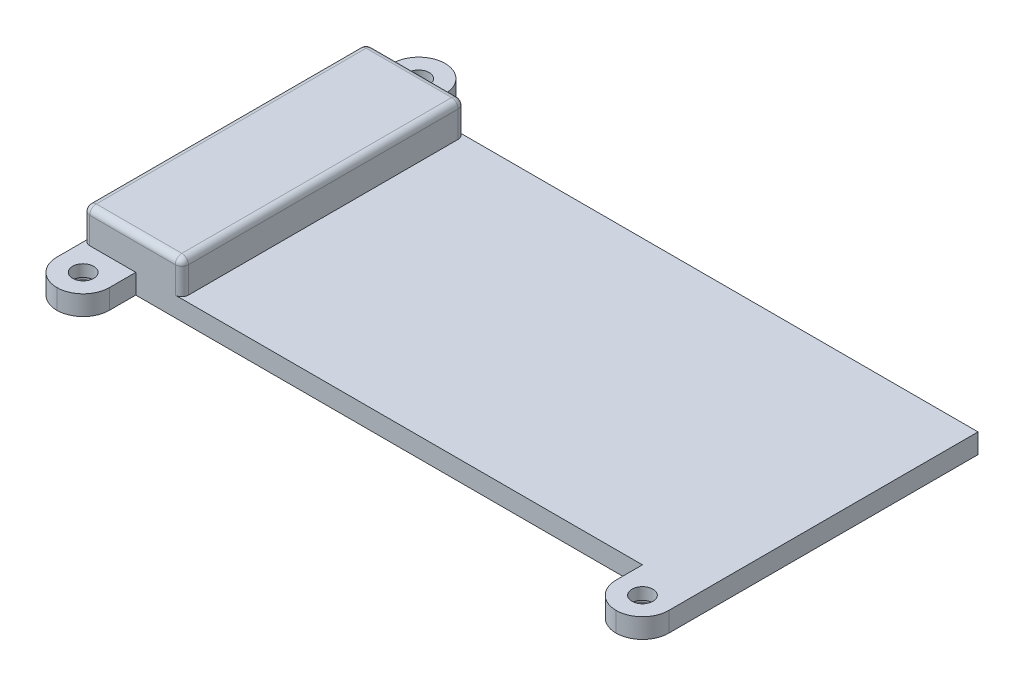
ISO-10303-21;
HEADER;
FILE_DESCRIPTION(('STEP AP214'),'2;1');
FILE_NAME('part.step','',(''),(''),'','','');
FILE_SCHEMA(('AUTOMOTIVE_DESIGN { 1 0 10303 214 1 1 1 1 }'));
ENDSEC;
DATA;
#1=APPLICATION_CONTEXT('core data for automotive mechanical design processes');
#2=APPLICATION_PROTOCOL_DEFINITION('international standard','automotive_design',2000,#1);
#3=PRODUCT_CONTEXT('',#1,'mechanical');
#4=PRODUCT('Part','Part','',(#3));
#5=PRODUCT_RELATED_PRODUCT_CATEGORY('part','',(#4));
#6=PRODUCT_DEFINITION_FORMATION('','',#4);
#7=PRODUCT_DEFINITION_CONTEXT('part definition',#1,'design');
#8=PRODUCT_DEFINITION('design','',#6,#7);
#9=PRODUCT_DEFINITION_SHAPE('','',#8);
#10=(LENGTH_UNIT() NAMED_UNIT(*) SI_UNIT(.MILLI.,.METRE.));
#11=(NAMED_UNIT(*) PLANE_ANGLE_UNIT() SI_UNIT($,.RADIAN.));
#12=(NAMED_UNIT(*) SI_UNIT($,.STERADIAN.) SOLID_ANGLE_UNIT());
#13=UNCERTAINTY_MEASURE_WITH_UNIT(LENGTH_MEASURE(1.E-05),#10,'distance_accuracy_value','');
#14=(GEOMETRIC_REPRESENTATION_CONTEXT(3) GLOBAL_UNCERTAINTY_ASSIGNED_CONTEXT((#13)) GLOBAL_UNIT_ASSIGNED_CONTEXT((#10,
#11,#12)) REPRESENTATION_CONTEXT('',''));
#15=CARTESIAN_POINT('',(0.,0.,0.));
#16=DIRECTION('',(0.,0.,1.));
#17=DIRECTION('',(1.,0.,0.));
#18=AXIS2_PLACEMENT_3D('',#15,#16,#17);
#19=CARTESIAN_POINT('',(0.,3.,0.));
#20=DIRECTION('',(0.,1.,0.));
#21=DIRECTION('',(0.,0.,1.));
#22=AXIS2_PLACEMENT_3D('',#19,#20,#21);
#23=PLANE('',#22);
#24=DIRECTION('',(0.,0.,-1.));
#25=VECTOR('',#24,1.);
#26=CARTESIAN_POINT('',(46.5,3.,-21.5));
#27=LINE('',#26,#25);
#28=CARTESIAN_POINT('',(46.4999999999999,3.,25.5));
#29=VERTEX_POINT('',#28);
#30=CARTESIAN_POINT('',(46.5,3.,-21.5));
#31=VERTEX_POINT('',#30);
#32=EDGE_CURVE('E214',#29,#31,#27,.T.);
#33=ORIENTED_EDGE('',*,*,#32,.T.);
#34=DIRECTION('',(-1.,0.,0.));
#35=VECTOR('',#34,1.);
#36=CARTESIAN_POINT('',(-38.5000000000001,3.,-21.4999999999999));
#37=LINE('',#36,#35);
#38=CARTESIAN_POINT('',(-32.5,3.,-21.4999999999999));
#39=VERTEX_POINT('',#38);
#40=EDGE_CURVE('E202',#31,#39,#37,.T.);
#41=ORIENTED_EDGE('',*,*,#40,.T.);
#42=CARTESIAN_POINT('',(-32.5,3.,-20.4999999999999));
#43=DIRECTION('',(0.,1.,0.));
#44=DIRECTION('',(0.,0.,1.));
#45=AXIS2_PLACEMENT_3D('',#42,#43,#44);
#46=CIRCLE('',#45,1.);
#47=CARTESIAN_POINT('',(-31.5,3.,-20.4999999999999));
#48=VERTEX_POINT('',#47);
#49=EDGE_CURVE('E55',#39,#48,#46,.F.);
#50=ORIENTED_EDGE('',*,*,#49,.T.);
#51=DIRECTION('',(0.,0.,-1.));
#52=VECTOR('',#51,1.);
#53=CARTESIAN_POINT('',(-31.5,3.,-21.5));
#54=LINE('',#53,#52);
#55=CARTESIAN_POINT('',(-31.5,3.,20.5000000000001));
#56=VERTEX_POINT('',#55);
#57=EDGE_CURVE('E471',#56,#48,#54,.T.);
#58=ORIENTED_EDGE('',*,*,#57,.F.);
#59=CARTESIAN_POINT('',(-32.5,3.,20.5000000000001));
#60=DIRECTION('',(0.,1.,0.));
#61=DIRECTION('',(0.,0.,1.));
#62=AXIS2_PLACEMENT_3D('',#59,#60,#61);
#63=CIRCLE('',#62,1.);
#64=CARTESIAN_POINT('',(-32.5,3.,21.5000000000001));
#65=VERTEX_POINT('',#64);
#66=EDGE_CURVE('E417',#56,#65,#63,.F.);
#67=ORIENTED_EDGE('',*,*,#66,.T.);
#68=DIRECTION('',(1.,0.,0.));
#69=VECTOR('',#68,1.);
#70=CARTESIAN_POINT('',(-38.5,3.,21.5000000000001));
#71=LINE('',#70,#69);
#72=CARTESIAN_POINT('',(38.5,3.,21.5));
#73=VERTEX_POINT('',#72);
#74=EDGE_CURVE('E247',#65,#73,#71,.T.);
#75=ORIENTED_EDGE('',*,*,#74,.T.);
#76=DIRECTION('',(0.,0.,1.));
#77=VECTOR('',#76,1.);
#78=CARTESIAN_POINT('',(38.5,3.,21.5));
#79=LINE('',#78,#77);
#80=CARTESIAN_POINT('',(38.5,3.,25.5));
#81=VERTEX_POINT('',#80);
#82=EDGE_CURVE('E250',#73,#81,#79,.T.);
#83=ORIENTED_EDGE('',*,*,#82,.T.);
#84=CARTESIAN_POINT('',(42.5,3.,25.5));
#85=DIRECTION('',(0.,1.,0.));
#86=DIRECTION('',(0.,0.,1.));
#87=AXIS2_PLACEMENT_3D('',#84,#85,#86);
#88=CIRCLE('',#87,4.);
#89=CARTESIAN_POINT('',(42.5,3.,29.5));
#90=VERTEX_POINT('',#89);
#91=EDGE_CURVE('E322',#81,#90,#88,.T.);
#92=ORIENTED_EDGE('',*,*,#91,.T.);
#93=CARTESIAN_POINT('',(42.5,3.,25.5));
#94=DIRECTION('',(0.,1.,0.));
#95=DIRECTION('',(0.,0.,1.));
#96=AXIS2_PLACEMENT_3D('',#93,#94,#95);
#97=CIRCLE('',#96,4.);
#98=EDGE_CURVE('E226',#90,#29,#97,.T.);
#99=ORIENTED_EDGE('',*,*,#98,.T.);
#100=EDGE_LOOP('',(#33,#41,#50,#58,#67,#75,#83,#92,#99));
#101=FACE_BOUND('',#100,.T.);
#102=CARTESIAN_POINT('',(42.5,3.,25.5));
#103=DIRECTION('',(0.,-1.,0.));
#104=DIRECTION('',(0.,0.,-1.));
#105=AXIS2_PLACEMENT_3D('',#102,#103,#104);
#106=CIRCLE('',#105,1.6);
#107=CARTESIAN_POINT('',(42.5,3.,23.9));
#108=VERTEX_POINT('',#107);
#109=EDGE_CURVE('E233',#108,#108,#106,.T.);
#110=ORIENTED_EDGE('',*,*,#109,.T.);
#111=EDGE_LOOP('',(#110));
#112=FACE_BOUND('',#111,.T.);
#113=ADVANCED_FACE('F45',(#101,#112),#23,.T.);
#114=DIRECTION('',(1.,0.,0.));
#115=VECTOR('',#114,1.);
#116=CARTESIAN_POINT('',(-31.5,3.,21.5000000000001));
#117=LINE('',#116,#115);
#118=CARTESIAN_POINT('',(-45.5,3.,21.5000000000001));
#119=VERTEX_POINT('',#118);
#120=CARTESIAN_POINT('',(-38.5,3.,21.5000000000001));
#121=VERTEX_POINT('',#120);
#122=EDGE_CURVE('E475',#119,#121,#117,.T.);
#123=ORIENTED_EDGE('',*,*,#122,.F.);
#124=CARTESIAN_POINT('',(-45.5,3.,20.5000000000001));
#125=DIRECTION('',(0.,1.,0.));
#126=DIRECTION('',(0.,0.,1.));
#127=AXIS2_PLACEMENT_3D('',#124,#125,#126);
#128=CIRCLE('',#127,1.);
#129=CARTESIAN_POINT('',(-46.5,3.,20.5000000000001));
#130=VERTEX_POINT('',#129);
#131=EDGE_CURVE('E421',#119,#130,#128,.F.);
#132=ORIENTED_EDGE('',*,*,#131,.T.);
#133=DIRECTION('',(0.,0.,1.));
#134=VECTOR('',#133,1.);
#135=CARTESIAN_POINT('',(-46.5,3.,-21.5));
#136=LINE('',#135,#134);
#137=CARTESIAN_POINT('',(-46.4999999999997,3.,25.5000000000001));
#138=VERTEX_POINT('',#137);
#139=EDGE_CURVE('E239',#130,#138,#136,.T.);
#140=ORIENTED_EDGE('',*,*,#139,.T.);
#141=CARTESIAN_POINT('',(-42.5,3.,25.5000000000001));
#142=DIRECTION('',(0.,1.,0.));
#143=DIRECTION('',(0.,0.,1.));
#144=AXIS2_PLACEMENT_3D('',#141,#142,#143);
#145=CIRCLE('',#144,4.);
#146=CARTESIAN_POINT('',(-42.5,3.,29.5000000000001));
#147=VERTEX_POINT('',#146);
#148=EDGE_CURVE('E317',#138,#147,#145,.T.);
#149=ORIENTED_EDGE('',*,*,#148,.T.);
#150=CARTESIAN_POINT('',(-42.5,3.,25.5000000000001));
#151=DIRECTION('',(0.,1.,0.));
#152=DIRECTION('',(0.,0.,1.));
#153=AXIS2_PLACEMENT_3D('',#150,#151,#152);
#154=CIRCLE('',#153,4.);
#155=CARTESIAN_POINT('',(-38.5,3.,25.5000000000001));
#156=VERTEX_POINT('',#155);
#157=EDGE_CURVE('E314',#147,#156,#154,.T.);
#158=ORIENTED_EDGE('',*,*,#157,.T.);
#159=DIRECTION('',(0.,0.,-1.));
#160=VECTOR('',#159,1.);
#161=CARTESIAN_POINT('',(-38.5,3.,21.5000000000001));
#162=LINE('',#161,#160);
#163=EDGE_CURVE('E243',#156,#121,#162,.T.);
#164=ORIENTED_EDGE('',*,*,#163,.T.);
#165=EDGE_LOOP('',(#123,#132,#140,#149,#158,#164));
#166=FACE_BOUND('',#165,.T.);
#167=CARTESIAN_POINT('',(-42.5,3.,25.5000000000001));
#168=DIRECTION('',(0.,-1.,0.));
#169=DIRECTION('',(0.,0.,1.));
#170=AXIS2_PLACEMENT_3D('',#167,#168,#169);
#171=CIRCLE('',#170,1.6);
#172=CARTESIAN_POINT('',(-42.5,3.,27.1000000000001));
#173=VERTEX_POINT('',#172);
#174=EDGE_CURVE('E367',#173,#173,#171,.T.);
#175=ORIENTED_EDGE('',*,*,#174,.T.);
#176=EDGE_LOOP('',(#175));
#177=FACE_BOUND('',#176,.T.);
#178=ADVANCED_FACE('F515',(#166,#177),#23,.T.);
#179=CARTESIAN_POINT('',(42.5,3.,25.5));
#180=DIRECTION('',(0.,-1.,0.));
#181=DIRECTION('',(0.,0.,-1.));
#182=AXIS2_PLACEMENT_3D('',#179,#180,#181);
#183=CYLINDRICAL_SURFACE('',#182,1.6);
#184=ORIENTED_EDGE('',*,*,#109,.F.);
#185=EDGE_LOOP('',(#184));
#186=FACE_BOUND('',#185,.T.);
#187=CARTESIAN_POINT('',(42.5,1.2,25.5));
#188=DIRECTION('',(0.,-1.,0.));
#189=DIRECTION('',(0.,0.,-1.));
#190=AXIS2_PLACEMENT_3D('',#187,#188,#189);
#191=CIRCLE('',#190,1.6);
#192=CARTESIAN_POINT('',(42.5,1.2,23.9));
#193=VERTEX_POINT('',#192);
#194=EDGE_CURVE('E363',#193,#193,#191,.F.);
#195=ORIENTED_EDGE('',*,*,#194,.F.);
#196=EDGE_LOOP('',(#195));
#197=FACE_BOUND('',#196,.T.);
#198=ADVANCED_FACE('F541',(#186,#197),#183,.F.);
#199=CARTESIAN_POINT('',(-42.5,3.,-25.4999999999999));
#200=DIRECTION('',(0.,-1.,0.));
#201=DIRECTION('',(0.,0.,-1.));
#202=AXIS2_PLACEMENT_3D('',#199,#200,#201);
#203=CYLINDRICAL_SURFACE('',#202,1.6);
#204=CARTESIAN_POINT('',(-42.5,3.,-25.4999999999999));
#205=DIRECTION('',(0.,-1.,0.));
#206=DIRECTION('',(0.,0.,-1.));
#207=AXIS2_PLACEMENT_3D('',#204,#205,#206);
#208=CIRCLE('',#207,1.6);
#209=CARTESIAN_POINT('',(-42.5,3.,-27.0999999999999));
#210=VERTEX_POINT('',#209);
#211=EDGE_CURVE('E508',#210,#210,#208,.T.);
#212=ORIENTED_EDGE('',*,*,#211,.F.);
#213=EDGE_LOOP('',(#212));
#214=FACE_BOUND('',#213,.T.);
#215=CARTESIAN_POINT('',(-42.5,1.2,-25.4999999999999));
#216=DIRECTION('',(0.,-1.,0.));
#217=DIRECTION('',(0.,0.,-1.));
#218=AXIS2_PLACEMENT_3D('',#215,#216,#217);
#219=CIRCLE('',#218,1.6);
#220=CARTESIAN_POINT('',(-42.5,1.2,-27.0999999999999));
#221=VERTEX_POINT('',#220);
#222=EDGE_CURVE('E358',#221,#221,#219,.F.);
#223=ORIENTED_EDGE('',*,*,#222,.F.);
#224=EDGE_LOOP('',(#223));
#225=FACE_BOUND('',#224,.T.);
#226=ADVANCED_FACE('F559',(#214,#225),#203,.F.);
#227=CARTESIAN_POINT('',(-38.5000000000001,3.,-21.4999999999999));
#228=DIRECTION('',(0.,0.,1.));
#229=DIRECTION('',(1.,0.,0.));
#230=AXIS2_PLACEMENT_3D('',#227,#228,#229);
#231=PLANE('',#230);
#232=DIRECTION('',(0.,-1.,0.));
#233=VECTOR('',#232,1.);
#234=CARTESIAN_POINT('',(-32.5,3.,-21.4999999999999));
#235=LINE('',#234,#233);
#236=CARTESIAN_POINT('',(-32.5,7.,-21.4999999999999));
#237=VERTEX_POINT('',#236);
#238=EDGE_CURVE('E208',#237,#39,#235,.T.);
#239=ORIENTED_EDGE('',*,*,#238,.T.);
#240=ORIENTED_EDGE('',*,*,#40,.F.);
#241=DIRECTION('',(0.,1.,0.));
#242=VECTOR('',#241,1.);
#243=CARTESIAN_POINT('',(46.5,3.,-21.5));
#244=LINE('',#243,#242);
#245=CARTESIAN_POINT('',(46.5,0.,-21.5));
#246=VERTEX_POINT('',#245);
#247=EDGE_CURVE('E205',#246,#31,#244,.T.);
#248=ORIENTED_EDGE('',*,*,#247,.F.);
#249=DIRECTION('',(-1.,0.,0.));
#250=VECTOR('',#249,1.);
#251=CARTESIAN_POINT('',(-38.5000000000001,0.,-21.4999999999999));
#252=LINE('',#251,#250);
#253=CARTESIAN_POINT('',(-38.5000000000001,0.,-21.4999999999999));
#254=VERTEX_POINT('',#253);
#255=EDGE_CURVE('E63',#246,#254,#252,.T.);
#256=ORIENTED_EDGE('',*,*,#255,.T.);
#257=DIRECTION('',(0.,-1.,0.));
#258=VECTOR('',#257,1.);
#259=CARTESIAN_POINT('',(-38.5000000000001,3.,-21.4999999999999));
#260=LINE('',#259,#258);
#261=CARTESIAN_POINT('',(-38.5000000000001,3.,-21.4999999999999));
#262=VERTEX_POINT('',#261);
#263=EDGE_CURVE('E282',#262,#254,#260,.T.);
#264=ORIENTED_EDGE('',*,*,#263,.F.);
#265=DIRECTION('',(-1.,0.,0.));
#266=VECTOR('',#265,1.);
#267=CARTESIAN_POINT('',(-31.5,3.,-21.5));
#268=LINE('',#267,#266);
#269=CARTESIAN_POINT('',(-45.5000000000003,3.,-21.4999999999999));
#270=VERTEX_POINT('',#269);
#271=EDGE_CURVE('E342',#262,#270,#268,.T.);
#272=ORIENTED_EDGE('',*,*,#271,.T.);
#273=DIRECTION('',(0.,-1.,0.));
#274=VECTOR('',#273,1.);
#275=CARTESIAN_POINT('',(-45.5000000000003,3.,-21.4999999999999));
#276=LINE('',#275,#274);
#277=CARTESIAN_POINT('',(-45.5000000000003,7.,-21.4999999999999));
#278=VERTEX_POINT('',#277);
#279=EDGE_CURVE('E401',#270,#278,#276,.F.);
#280=ORIENTED_EDGE('',*,*,#279,.T.);
#281=DIRECTION('',(-1.,0.,0.));
#282=VECTOR('',#281,1.);
#283=CARTESIAN_POINT('',(-38.5000000000001,7.,-21.4999999999999));
#284=LINE('',#283,#282);
#285=EDGE_CURVE('E404',#278,#237,#284,.F.);
#286=ORIENTED_EDGE('',*,*,#285,.T.);
#287=EDGE_LOOP('',(#239,#240,#248,#256,#264,#272,#280,#286));
#288=FACE_BOUND('',#287,.T.);
#289=ADVANCED_FACE('F204',(#288),#231,.F.);
#290=CARTESIAN_POINT('',(-38.5000000000001,3.,-21.4999999999999));
#291=DIRECTION('',(-1.,0.,0.));
#292=DIRECTION('',(0.,0.,1.));
#293=AXIS2_PLACEMENT_3D('',#290,#291,#292);
#294=PLANE('',#293);
#295=DIRECTION('',(0.,0.,-1.));
#296=VECTOR('',#295,1.);
#297=CARTESIAN_POINT('',(-38.5000000000001,0.,-21.4999999999999));
#298=LINE('',#297,#296);
#299=CARTESIAN_POINT('',(-38.5000000000001,0.,-25.4999999999999));
#300=VERTEX_POINT('',#299);
#301=EDGE_CURVE('E257',#254,#300,#298,.T.);
#302=ORIENTED_EDGE('',*,*,#301,.T.);
#303=DIRECTION('',(0.,-1.,0.));
#304=VECTOR('',#303,1.);
#305=CARTESIAN_POINT('',(-38.5000000000001,3.,-25.4999999999999));
#306=LINE('',#305,#304);
#307=CARTESIAN_POINT('',(-38.5000000000001,3.,-25.4999999999999));
#308=VERTEX_POINT('',#307);
#309=EDGE_CURVE('E339',#300,#308,#306,.F.);
#310=ORIENTED_EDGE('',*,*,#309,.T.);
#311=DIRECTION('',(0.,0.,-1.));
#312=VECTOR('',#311,1.);
#313=CARTESIAN_POINT('',(-38.5000000000001,3.,-21.4999999999999));
#314=LINE('',#313,#312);
#315=EDGE_CURVE('E213',#262,#308,#314,.T.);
#316=ORIENTED_EDGE('',*,*,#315,.F.);
#317=ORIENTED_EDGE('',*,*,#263,.T.);
#318=EDGE_LOOP('',(#302,#310,#316,#317));
#319=FACE_BOUND('',#318,.T.);
#320=ADVANCED_FACE('F779',(#319),#294,.F.);
#321=CARTESIAN_POINT('',(-46.5,3.,21.5));
#322=DIRECTION('',(1.,0.,0.));
#323=DIRECTION('',(0.,0.,-1.));
#324=AXIS2_PLACEMENT_3D('',#321,#322,#323);
#325=PLANE('',#324);
#326=ORIENTED_EDGE('',*,*,#139,.F.);
#327=DIRECTION('',(0.,-1.,0.));
#328=VECTOR('',#327,1.);
#329=CARTESIAN_POINT('',(-46.5,3.,20.5000000000001));
#330=LINE('',#329,#328);
#331=CARTESIAN_POINT('',(-46.5,7.,20.5000000000001));
#332=VERTEX_POINT('',#331);
#333=EDGE_CURVE('E398',#130,#332,#330,.F.);
#334=ORIENTED_EDGE('',*,*,#333,.T.);
#335=DIRECTION('',(0.,0.,1.));
#336=VECTOR('',#335,1.);
#337=CARTESIAN_POINT('',(-46.5,7.,21.5));
#338=LINE('',#337,#336);
#339=CARTESIAN_POINT('',(-46.5000000000003,7.,-20.4999999999999));
#340=VERTEX_POINT('',#339);
#341=EDGE_CURVE('E395',#332,#340,#338,.F.);
#342=ORIENTED_EDGE('',*,*,#341,.T.);
#343=DIRECTION('',(0.,-1.,0.));
#344=VECTOR('',#343,1.);
#345=CARTESIAN_POINT('',(-46.5000000000003,3.,-20.4999999999999));
#346=LINE('',#345,#344);
#347=CARTESIAN_POINT('',(-46.5,3.,-20.4999999999999));
#348=VERTEX_POINT('',#347);
#349=EDGE_CURVE('E391',#340,#348,#346,.T.);
#350=ORIENTED_EDGE('',*,*,#349,.T.);
#351=CARTESIAN_POINT('',(-46.5,3.,-25.4999999999999));
#352=VERTEX_POINT('',#351);
#353=EDGE_CURVE('E240',#352,#348,#136,.T.);
#354=ORIENTED_EDGE('',*,*,#353,.F.);
#355=DIRECTION('',(0.,-1.,0.));
#356=VECTOR('',#355,1.);
#357=CARTESIAN_POINT('',(-46.5000000000003,3.,-25.4999999999999));
#358=LINE('',#357,#356);
#359=CARTESIAN_POINT('',(-46.5000000000003,0.,-25.4999999999999));
#360=VERTEX_POINT('',#359);
#361=EDGE_CURVE('E328',#352,#360,#358,.T.);
#362=ORIENTED_EDGE('',*,*,#361,.T.);
#363=DIRECTION('',(0.,0.,1.));
#364=VECTOR('',#363,1.);
#365=CARTESIAN_POINT('',(-46.5,0.,21.5));
#366=LINE('',#365,#364);
#367=CARTESIAN_POINT('',(-46.5,0.,25.5000000000001));
#368=VERTEX_POINT('',#367);
#369=EDGE_CURVE('E262',#360,#368,#366,.T.);
#370=ORIENTED_EDGE('',*,*,#369,.T.);
#371=DIRECTION('',(0.,-1.,0.));
#372=VECTOR('',#371,1.);
#373=CARTESIAN_POINT('',(-46.5,3.,25.5000000000001));
#374=LINE('',#373,#372);
#375=EDGE_CURVE('E332',#368,#138,#374,.F.);
#376=ORIENTED_EDGE('',*,*,#375,.T.);
#377=EDGE_LOOP('',(#326,#334,#342,#350,#354,#362,#370,#376));
#378=FACE_BOUND('',#377,.T.);
#379=ADVANCED_FACE('F664',(#378),#325,.F.);
#380=CARTESIAN_POINT('',(-38.5,3.,21.5000000000001));
#381=DIRECTION('',(-1.,0.,0.));
#382=DIRECTION('',(0.,0.,1.));
#383=AXIS2_PLACEMENT_3D('',#380,#381,#382);
#384=PLANE('',#383);
#385=ORIENTED_EDGE('',*,*,#163,.F.);
#386=DIRECTION('',(0.,-1.,0.));
#387=VECTOR('',#386,1.);
#388=CARTESIAN_POINT('',(-38.5,3.,25.5000000000001));
#389=LINE('',#388,#387);
#390=CARTESIAN_POINT('',(-38.5,0.,25.5000000000001));
#391=VERTEX_POINT('',#390);
#392=EDGE_CURVE('E336',#156,#391,#389,.T.);
#393=ORIENTED_EDGE('',*,*,#392,.T.);
#394=DIRECTION('',(0.,0.,-1.));
#395=VECTOR('',#394,1.);
#396=CARTESIAN_POINT('',(-38.5,0.,21.5000000000001));
#397=LINE('',#396,#395);
#398=CARTESIAN_POINT('',(-38.5,0.,21.5000000000001));
#399=VERTEX_POINT('',#398);
#400=EDGE_CURVE('E266',#391,#399,#397,.T.);
#401=ORIENTED_EDGE('',*,*,#400,.T.);
#402=DIRECTION('',(0.,-1.,0.));
#403=VECTOR('',#402,1.);
#404=CARTESIAN_POINT('',(-38.5,3.,21.5000000000001));
#405=LINE('',#404,#403);
#406=EDGE_CURVE('E278',#121,#399,#405,.T.);
#407=ORIENTED_EDGE('',*,*,#406,.F.);
#408=EDGE_LOOP('',(#385,#393,#401,#407));
#409=FACE_BOUND('',#408,.T.);
#410=ADVANCED_FACE('F653',(#409),#384,.F.);
#411=CARTESIAN_POINT('',(-38.5,3.,21.5000000000001));
#412=DIRECTION('',(0.,0.,-1.));
#413=DIRECTION('',(-1.,0.,0.));
#414=AXIS2_PLACEMENT_3D('',#411,#412,#413);
#415=PLANE('',#414);
#416=ORIENTED_EDGE('',*,*,#74,.F.);
#417=DIRECTION('',(0.,-1.,0.));
#418=VECTOR('',#417,1.);
#419=CARTESIAN_POINT('',(-32.5,3.,21.5000000000001));
#420=LINE('',#419,#418);
#421=CARTESIAN_POINT('',(-32.5,7.,21.5000000000001));
#422=VERTEX_POINT('',#421);
#423=EDGE_CURVE('E388',#65,#422,#420,.F.);
#424=ORIENTED_EDGE('',*,*,#423,.T.);
#425=DIRECTION('',(1.,0.,0.));
#426=VECTOR('',#425,1.);
#427=CARTESIAN_POINT('',(-38.5,7.,21.5000000000001));
#428=LINE('',#427,#426);
#429=CARTESIAN_POINT('',(-45.5,7.,21.5000000000001));
#430=VERTEX_POINT('',#429);
#431=EDGE_CURVE('E384',#422,#430,#428,.F.);
#432=ORIENTED_EDGE('',*,*,#431,.T.);
#433=DIRECTION('',(0.,-1.,0.));
#434=VECTOR('',#433,1.);
#435=CARTESIAN_POINT('',(-45.5,3.,21.5000000000001));
#436=LINE('',#435,#434);
#437=EDGE_CURVE('E381',#430,#119,#436,.T.);
#438=ORIENTED_EDGE('',*,*,#437,.T.);
#439=ORIENTED_EDGE('',*,*,#122,.T.);
#440=ORIENTED_EDGE('',*,*,#406,.T.);
#441=DIRECTION('',(1.,0.,0.));
#442=VECTOR('',#441,1.);
#443=CARTESIAN_POINT('',(-38.5,0.,21.5000000000001));
#444=LINE('',#443,#442);
#445=CARTESIAN_POINT('',(38.5,0.,21.5));
#446=VERTEX_POINT('',#445);
#447=EDGE_CURVE('E269',#399,#446,#444,.T.);
#448=ORIENTED_EDGE('',*,*,#447,.T.);
#449=DIRECTION('',(0.,-1.,0.));
#450=VECTOR('',#449,1.);
#451=CARTESIAN_POINT('',(38.5,3.,21.5));
#452=LINE('',#451,#450);
#453=EDGE_CURVE('E254',#73,#446,#452,.T.);
#454=ORIENTED_EDGE('',*,*,#453,.F.);
#455=EDGE_LOOP('',(#416,#424,#432,#438,#439,#440,#448,#454));
#456=FACE_BOUND('',#455,.T.);
#457=ADVANCED_FACE('F634',(#456),#415,.F.);
#458=CARTESIAN_POINT('',(38.5,3.,21.5));
#459=DIRECTION('',(1.,0.,0.));
#460=DIRECTION('',(0.,0.,-1.));
#461=AXIS2_PLACEMENT_3D('',#458,#459,#460);
#462=PLANE('',#461);
#463=DIRECTION('',(0.,0.,1.));
#464=VECTOR('',#463,1.);
#465=CARTESIAN_POINT('',(38.5,0.,21.5));
#466=LINE('',#465,#464);
#467=CARTESIAN_POINT('',(38.5,0.,25.5));
#468=VERTEX_POINT('',#467);
#469=EDGE_CURVE('E230',#446,#468,#466,.T.);
#470=ORIENTED_EDGE('',*,*,#469,.T.);
#471=DIRECTION('',(0.,-1.,0.));
#472=VECTOR('',#471,1.);
#473=CARTESIAN_POINT('',(38.5,3.,25.5));
#474=LINE('',#473,#472);
#475=EDGE_CURVE('E304',#468,#81,#474,.F.);
#476=ORIENTED_EDGE('',*,*,#475,.T.);
#477=ORIENTED_EDGE('',*,*,#82,.F.);
#478=ORIENTED_EDGE('',*,*,#453,.T.);
#479=EDGE_LOOP('',(#470,#476,#477,#478));
#480=FACE_BOUND('',#479,.T.);
#481=ADVANCED_FACE('F553',(#480),#462,.F.);
#482=CARTESIAN_POINT('',(46.5,3.,21.5));
#483=DIRECTION('',(-1.,0.,0.));
#484=DIRECTION('',(0.,0.,1.));
#485=AXIS2_PLACEMENT_3D('',#482,#483,#484);
#486=PLANE('',#485);
#487=DIRECTION('',(0.,0.,-1.));
#488=VECTOR('',#487,1.);
#489=CARTESIAN_POINT('',(46.5,0.,21.5));
#490=LINE('',#489,#488);
#491=CARTESIAN_POINT('',(46.5,0.,25.5));
#492=VERTEX_POINT('',#491);
#493=EDGE_CURVE('E220',#492,#246,#490,.T.);
#494=ORIENTED_EDGE('',*,*,#493,.T.);
#495=ORIENTED_EDGE('',*,*,#247,.T.);
#496=ORIENTED_EDGE('',*,*,#32,.F.);
#497=DIRECTION('',(0.,-1.,0.));
#498=VECTOR('',#497,1.);
#499=CARTESIAN_POINT('',(46.5,3.,25.5));
#500=LINE('',#499,#498);
#501=EDGE_CURVE('E325',#29,#492,#500,.T.);
#502=ORIENTED_EDGE('',*,*,#501,.T.);
#503=EDGE_LOOP('',(#494,#495,#496,#502));
#504=FACE_BOUND('',#503,.T.);
#505=ADVANCED_FACE('F218',(#504),#486,.F.);
#506=ORIENTED_EDGE('',*,*,#271,.F.);
#507=ORIENTED_EDGE('',*,*,#315,.T.);
#508=CARTESIAN_POINT('',(-42.5000000000001,3.,-25.4999999999999));
#509=DIRECTION('',(0.,1.,0.));
#510=DIRECTION('',(0.,0.,1.));
#511=AXIS2_PLACEMENT_3D('',#508,#509,#510);
#512=CIRCLE('',#511,4.);
#513=CARTESIAN_POINT('',(-42.5000000000001,3.,-29.4999999999999));
#514=VERTEX_POINT('',#513);
#515=EDGE_CURVE('E308',#308,#514,#512,.T.);
#516=ORIENTED_EDGE('',*,*,#515,.T.);
#517=CARTESIAN_POINT('',(-42.5000000000003,3.,-25.4999999999999));
#518=DIRECTION('',(0.,1.,0.));
#519=DIRECTION('',(0.,0.,1.));
#520=AXIS2_PLACEMENT_3D('',#517,#518,#519);
#521=CIRCLE('',#520,4.);
#522=EDGE_CURVE('E311',#514,#352,#521,.T.);
#523=ORIENTED_EDGE('',*,*,#522,.T.);
#524=ORIENTED_EDGE('',*,*,#353,.T.);
#525=CARTESIAN_POINT('',(-45.5000000000003,3.,-20.4999999999999));
#526=DIRECTION('',(0.,1.,0.));
#527=DIRECTION('',(0.,0.,1.));
#528=AXIS2_PLACEMENT_3D('',#525,#526,#527);
#529=CIRCLE('',#528,1.);
#530=EDGE_CURVE('E11',#348,#270,#529,.F.);
#531=ORIENTED_EDGE('',*,*,#530,.T.);
#532=EDGE_LOOP('',(#506,#507,#516,#523,#524,#531));
#533=FACE_BOUND('',#532,.T.);
#534=ORIENTED_EDGE('',*,*,#211,.T.);
#535=EDGE_LOOP('',(#534));
#536=FACE_BOUND('',#535,.T.);
#537=ADVANCED_FACE('F537',(#533,#536),#23,.T.);
#538=CARTESIAN_POINT('',(0.,0.,0.));
#539=DIRECTION('',(0.,1.,0.));
#540=DIRECTION('',(0.,0.,1.));
#541=AXIS2_PLACEMENT_3D('',#538,#539,#540);
#542=PLANE('',#541);
#543=CARTESIAN_POINT('',(-42.5,0.,-25.5));
#544=DIRECTION('',(0.,-1.,0.));
#545=DIRECTION('',(0.,0.,-1.));
#546=AXIS2_PLACEMENT_3D('',#543,#544,#545);
#547=CIRCLE('',#546,2.8);
#548=CARTESIAN_POINT('',(-42.5,0.,-28.3));
#549=VERTEX_POINT('',#548);
#550=EDGE_CURVE('E495',#549,#549,#547,.T.);
#551=ORIENTED_EDGE('',*,*,#550,.F.);
#552=EDGE_LOOP('',(#551));
#553=FACE_BOUND('',#552,.T.);
#554=CARTESIAN_POINT('',(42.5,0.,25.5));
#555=DIRECTION('',(0.,-1.,0.));
#556=DIRECTION('',(0.,0.,-1.));
#557=AXIS2_PLACEMENT_3D('',#554,#555,#556);
#558=CIRCLE('',#557,2.8);
#559=CARTESIAN_POINT('',(42.5,0.,22.7));
#560=VERTEX_POINT('',#559);
#561=EDGE_CURVE('E486',#560,#560,#558,.T.);
#562=ORIENTED_EDGE('',*,*,#561,.F.);
#563=EDGE_LOOP('',(#562));
#564=FACE_BOUND('',#563,.T.);
#565=CARTESIAN_POINT('',(-42.5,0.,25.5));
#566=DIRECTION('',(0.,-1.,0.));
#567=DIRECTION('',(0.,0.,1.));
#568=AXIS2_PLACEMENT_3D('',#565,#566,#567);
#569=CIRCLE('',#568,2.8);
#570=CARTESIAN_POINT('',(-42.5,0.,28.3));
#571=VERTEX_POINT('',#570);
#572=EDGE_CURVE('E490',#571,#571,#569,.T.);
#573=ORIENTED_EDGE('',*,*,#572,.F.);
#574=EDGE_LOOP('',(#573));
#575=FACE_BOUND('',#574,.T.);
#576=ORIENTED_EDGE('',*,*,#255,.F.);
#577=ORIENTED_EDGE('',*,*,#493,.F.);
#578=CARTESIAN_POINT('',(42.5,0.,25.5));
#579=DIRECTION('',(0.,1.,0.));
#580=DIRECTION('',(0.,0.,1.));
#581=AXIS2_PLACEMENT_3D('',#578,#579,#580);
#582=CIRCLE('',#581,4.);
#583=CARTESIAN_POINT('',(42.5,0.,29.5));
#584=VERTEX_POINT('',#583);
#585=EDGE_CURVE('E298',#492,#584,#582,.F.);
#586=ORIENTED_EDGE('',*,*,#585,.T.);
#587=CARTESIAN_POINT('',(42.5,0.,25.5));
#588=DIRECTION('',(0.,1.,0.));
#589=DIRECTION('',(0.,0.,1.));
#590=AXIS2_PLACEMENT_3D('',#587,#588,#589);
#591=CIRCLE('',#590,4.);
#592=EDGE_CURVE('E301',#584,#468,#591,.F.);
#593=ORIENTED_EDGE('',*,*,#592,.T.);
#594=ORIENTED_EDGE('',*,*,#469,.F.);
#595=ORIENTED_EDGE('',*,*,#447,.F.);
#596=ORIENTED_EDGE('',*,*,#400,.F.);
#597=CARTESIAN_POINT('',(-42.5,0.,25.5000000000001));
#598=DIRECTION('',(0.,1.,0.));
#599=DIRECTION('',(0.,0.,1.));
#600=AXIS2_PLACEMENT_3D('',#597,#598,#599);
#601=CIRCLE('',#600,4.);
#602=CARTESIAN_POINT('',(-42.5,0.,29.5000000000001));
#603=VERTEX_POINT('',#602);
#604=EDGE_CURVE('E292',#391,#603,#601,.F.);
#605=ORIENTED_EDGE('',*,*,#604,.T.);
#606=CARTESIAN_POINT('',(-42.5,0.,25.5000000000001));
#607=DIRECTION('',(0.,1.,0.));
#608=DIRECTION('',(0.,0.,1.));
#609=AXIS2_PLACEMENT_3D('',#606,#607,#608);
#610=CIRCLE('',#609,4.);
#611=EDGE_CURVE('E295',#603,#368,#610,.F.);
#612=ORIENTED_EDGE('',*,*,#611,.T.);
#613=ORIENTED_EDGE('',*,*,#369,.F.);
#614=CARTESIAN_POINT('',(-42.5000000000003,0.,-25.4999999999999));
#615=DIRECTION('',(0.,1.,0.));
#616=DIRECTION('',(0.,0.,1.));
#617=AXIS2_PLACEMENT_3D('',#614,#615,#616);
#618=CIRCLE('',#617,4.);
#619=CARTESIAN_POINT('',(-42.5000000000001,0.,-29.4999999999999));
#620=VERTEX_POINT('',#619);
#621=EDGE_CURVE('E289',#360,#620,#618,.F.);
#622=ORIENTED_EDGE('',*,*,#621,.T.);
#623=CARTESIAN_POINT('',(-42.5000000000001,0.,-25.4999999999999));
#624=DIRECTION('',(0.,1.,0.));
#625=DIRECTION('',(0.,0.,1.));
#626=AXIS2_PLACEMENT_3D('',#623,#624,#625);
#627=CIRCLE('',#626,4.);
#628=EDGE_CURVE('E286',#620,#300,#627,.F.);
#629=ORIENTED_EDGE('',*,*,#628,.T.);
#630=ORIENTED_EDGE('',*,*,#301,.F.);
#631=EDGE_LOOP('',(#576,#577,#586,#593,#594,#595,#596,#605,#612,#613,#622,#629,#630));
#632=FACE_BOUND('',#631,.T.);
#633=ADVANCED_FACE('F545',(#553,#564,#575,#632),#542,.F.);
#634=CARTESIAN_POINT('',(42.5,3.,25.5));
#635=DIRECTION('',(0.,-1.,0.));
#636=DIRECTION('',(0.,0.,-1.));
#637=AXIS2_PLACEMENT_3D('',#634,#635,#636);
#638=CYLINDRICAL_SURFACE('',#637,4.);
#639=ORIENTED_EDGE('',*,*,#501,.F.);
#640=ORIENTED_EDGE('',*,*,#98,.F.);
#641=DIRECTION('',(0.,-1.,0.));
#642=VECTOR('',#641,1.);
#643=CARTESIAN_POINT('',(42.5,3.,29.5));
#644=LINE('',#643,#642);
#645=EDGE_CURVE('E258',#584,#90,#644,.F.);
#646=ORIENTED_EDGE('',*,*,#645,.F.);
#647=ORIENTED_EDGE('',*,*,#585,.F.);
#648=EDGE_LOOP('',(#639,#640,#646,#647));
#649=FACE_BOUND('',#648,.T.);
#650=ADVANCED_FACE('F551',(#649),#638,.T.);
#651=CARTESIAN_POINT('',(42.5,3.,25.5));
#652=DIRECTION('',(0.,-1.,0.));
#653=DIRECTION('',(0.,0.,-1.));
#654=AXIS2_PLACEMENT_3D('',#651,#652,#653);
#655=CYLINDRICAL_SURFACE('',#654,4.);
#656=ORIENTED_EDGE('',*,*,#91,.F.);
#657=ORIENTED_EDGE('',*,*,#475,.F.);
#658=ORIENTED_EDGE('',*,*,#592,.F.);
#659=ORIENTED_EDGE('',*,*,#645,.T.);
#660=EDGE_LOOP('',(#656,#657,#658,#659));
#661=FACE_BOUND('',#660,.T.);
#662=ADVANCED_FACE('F642',(#661),#655,.T.);
#663=CARTESIAN_POINT('',(-42.5,3.,25.5000000000001));
#664=DIRECTION('',(0.,-1.,0.));
#665=DIRECTION('',(0.,0.,-1.));
#666=AXIS2_PLACEMENT_3D('',#663,#664,#665);
#667=CYLINDRICAL_SURFACE('',#666,4.);
#668=ORIENTED_EDGE('',*,*,#392,.F.);
#669=ORIENTED_EDGE('',*,*,#157,.F.);
#670=DIRECTION('',(0.,-1.,0.));
#671=VECTOR('',#670,1.);
#672=CARTESIAN_POINT('',(-42.5,3.,29.5000000000001));
#673=LINE('',#672,#671);
#674=EDGE_CURVE('E346',#603,#147,#673,.F.);
#675=ORIENTED_EDGE('',*,*,#674,.F.);
#676=ORIENTED_EDGE('',*,*,#604,.F.);
#677=EDGE_LOOP('',(#668,#669,#675,#676));
#678=FACE_BOUND('',#677,.T.);
#679=ADVANCED_FACE('F657',(#678),#667,.T.);
#680=CARTESIAN_POINT('',(-42.5,3.,25.5000000000001));
#681=DIRECTION('',(0.,-1.,0.));
#682=DIRECTION('',(0.,0.,-1.));
#683=AXIS2_PLACEMENT_3D('',#680,#681,#682);
#684=CYLINDRICAL_SURFACE('',#683,4.);
#685=ORIENTED_EDGE('',*,*,#148,.F.);
#686=ORIENTED_EDGE('',*,*,#375,.F.);
#687=ORIENTED_EDGE('',*,*,#611,.F.);
#688=ORIENTED_EDGE('',*,*,#674,.T.);
#689=EDGE_LOOP('',(#685,#686,#687,#688));
#690=FACE_BOUND('',#689,.T.);
#691=ADVANCED_FACE('F668',(#690),#684,.T.);
#692=CARTESIAN_POINT('',(-42.5000000000001,3.,-25.4999999999999));
#693=DIRECTION('',(0.,-1.,0.));
#694=DIRECTION('',(0.,0.,-1.));
#695=AXIS2_PLACEMENT_3D('',#692,#693,#694);
#696=CYLINDRICAL_SURFACE('',#695,4.);
#697=DIRECTION('',(0.,-1.,0.));
#698=VECTOR('',#697,1.);
#699=CARTESIAN_POINT('',(-42.5000000000001,3.,-29.4999999999999));
#700=LINE('',#699,#698);
#701=EDGE_CURVE('E350',#514,#620,#700,.T.);
#702=ORIENTED_EDGE('',*,*,#701,.F.);
#703=ORIENTED_EDGE('',*,*,#515,.F.);
#704=ORIENTED_EDGE('',*,*,#309,.F.);
#705=ORIENTED_EDGE('',*,*,#628,.F.);
#706=EDGE_LOOP('',(#702,#703,#704,#705));
#707=FACE_BOUND('',#706,.T.);
#708=ADVANCED_FACE('F530',(#707),#696,.T.);
#709=CARTESIAN_POINT('',(-42.5000000000003,3.,-25.4999999999999));
#710=DIRECTION('',(0.,-1.,0.));
#711=DIRECTION('',(0.,0.,-1.));
#712=AXIS2_PLACEMENT_3D('',#709,#710,#711);
#713=CYLINDRICAL_SURFACE('',#712,4.);
#714=ORIENTED_EDGE('',*,*,#522,.F.);
#715=ORIENTED_EDGE('',*,*,#701,.T.);
#716=ORIENTED_EDGE('',*,*,#621,.F.);
#717=ORIENTED_EDGE('',*,*,#361,.F.);
#718=EDGE_LOOP('',(#714,#715,#716,#717));
#719=FACE_BOUND('',#718,.T.);
#720=ADVANCED_FACE('F520',(#719),#713,.T.);
#721=CARTESIAN_POINT('',(-42.5,3.,25.5000000000001));
#722=DIRECTION('',(0.,-1.,0.));
#723=DIRECTION('',(0.,0.,-1.));
#724=AXIS2_PLACEMENT_3D('',#721,#722,#723);
#725=CYLINDRICAL_SURFACE('',#724,1.6);
#726=CARTESIAN_POINT('',(-42.5,1.2,25.5000000000001));
#727=DIRECTION('',(0.,1.,0.));
#728=DIRECTION('',(0.,0.,1.));
#729=AXIS2_PLACEMENT_3D('',#726,#727,#728);
#730=CIRCLE('',#729,1.6);
#731=CARTESIAN_POINT('',(-42.5,1.2,27.1000000000001));
#732=VERTEX_POINT('',#731);
#733=EDGE_CURVE('E354',#732,#732,#730,.F.);
#734=ORIENTED_EDGE('',*,*,#733,.T.);
#735=EDGE_LOOP('',(#734));
#736=FACE_BOUND('',#735,.T.);
#737=ORIENTED_EDGE('',*,*,#174,.F.);
#738=EDGE_LOOP('',(#737));
#739=FACE_BOUND('',#738,.T.);
#740=ADVANCED_FACE('F517',(#736,#739),#725,.F.);
#741=CARTESIAN_POINT('',(-42.5,1.2,25.5));
#742=DIRECTION('',(0.,1.,0.));
#743=DIRECTION('',(0.,0.,1.));
#744=AXIS2_PLACEMENT_3D('',#741,#742,#743);
#745=PLANE('',#744);
#746=CARTESIAN_POINT('',(-42.5,1.2,25.5));
#747=DIRECTION('',(0.,-1.,0.));
#748=DIRECTION('',(0.,0.,1.));
#749=AXIS2_PLACEMENT_3D('',#746,#747,#748);
#750=CIRCLE('',#749,2.8);
#751=CARTESIAN_POINT('',(-42.5,1.2,28.3));
#752=VERTEX_POINT('',#751);
#753=EDGE_CURVE('E359',#752,#752,#750,.T.);
#754=ORIENTED_EDGE('',*,*,#753,.T.);
#755=EDGE_LOOP('',(#754));
#756=FACE_BOUND('',#755,.T.);
#757=ORIENTED_EDGE('',*,*,#733,.F.);
#758=EDGE_LOOP('',(#757));
#759=FACE_BOUND('',#758,.T.);
#760=ADVANCED_FACE('F519',(#756,#759),#745,.F.);
#761=CARTESIAN_POINT('',(-42.5,1.2,25.5));
#762=DIRECTION('',(0.,-1.,0.));
#763=DIRECTION('',(0.,0.,-1.));
#764=AXIS2_PLACEMENT_3D('',#761,#762,#763);
#765=CYLINDRICAL_SURFACE('',#764,2.8);
#766=ORIENTED_EDGE('',*,*,#753,.F.);
#767=EDGE_LOOP('',(#766));
#768=FACE_BOUND('',#767,.T.);
#769=ORIENTED_EDGE('',*,*,#572,.T.);
#770=EDGE_LOOP('',(#769));
#771=FACE_BOUND('',#770,.T.);
#772=ADVANCED_FACE('F527',(#768,#771),#765,.F.);
#773=CARTESIAN_POINT('',(-42.5,1.2,-25.5));
#774=DIRECTION('',(0.,-1.,0.));
#775=DIRECTION('',(0.,0.,-1.));
#776=AXIS2_PLACEMENT_3D('',#773,#774,#775);
#777=PLANE('',#776);
#778=CARTESIAN_POINT('',(-42.5,1.2,-25.5));
#779=DIRECTION('',(0.,-1.,0.));
#780=DIRECTION('',(0.,0.,-1.));
#781=AXIS2_PLACEMENT_3D('',#778,#779,#780);
#782=CIRCLE('',#781,2.8);
#783=CARTESIAN_POINT('',(-42.5,1.2,-28.3));
#784=VERTEX_POINT('',#783);
#785=EDGE_CURVE('E480',#784,#784,#782,.T.);
#786=ORIENTED_EDGE('',*,*,#785,.T.);
#787=EDGE_LOOP('',(#786));
#788=FACE_BOUND('',#787,.T.);
#789=ORIENTED_EDGE('',*,*,#222,.T.);
#790=EDGE_LOOP('',(#789));
#791=FACE_BOUND('',#790,.T.);
#792=ADVANCED_FACE('F564',(#788,#791),#777,.T.);
#793=CARTESIAN_POINT('',(-42.5,1.2,-25.5));
#794=DIRECTION('',(0.,-1.,0.));
#795=DIRECTION('',(0.,0.,-1.));
#796=AXIS2_PLACEMENT_3D('',#793,#794,#795);
#797=CYLINDRICAL_SURFACE('',#796,2.8);
#798=ORIENTED_EDGE('',*,*,#785,.F.);
#799=EDGE_LOOP('',(#798));
#800=FACE_BOUND('',#799,.T.);
#801=ORIENTED_EDGE('',*,*,#550,.T.);
#802=EDGE_LOOP('',(#801));
#803=FACE_BOUND('',#802,.T.);
#804=ADVANCED_FACE('F566',(#800,#803),#797,.F.);
#805=CARTESIAN_POINT('',(42.5,1.2,25.5));
#806=DIRECTION('',(0.,-1.,0.));
#807=DIRECTION('',(0.,0.,-1.));
#808=AXIS2_PLACEMENT_3D('',#805,#806,#807);
#809=PLANE('',#808);
#810=CARTESIAN_POINT('',(42.5,1.2,25.5));
#811=DIRECTION('',(0.,-1.,0.));
#812=DIRECTION('',(0.,0.,-1.));
#813=AXIS2_PLACEMENT_3D('',#810,#811,#812);
#814=CIRCLE('',#813,2.8);
#815=CARTESIAN_POINT('',(42.5,1.2,22.7));
#816=VERTEX_POINT('',#815);
#817=EDGE_CURVE('E491',#816,#816,#814,.T.);
#818=ORIENTED_EDGE('',*,*,#817,.T.);
#819=EDGE_LOOP('',(#818));
#820=FACE_BOUND('',#819,.T.);
#821=ORIENTED_EDGE('',*,*,#194,.T.);
#822=EDGE_LOOP('',(#821));
#823=FACE_BOUND('',#822,.T.);
#824=ADVANCED_FACE('F573',(#820,#823),#809,.T.);
#825=CARTESIAN_POINT('',(42.5,1.2,25.5));
#826=DIRECTION('',(0.,-1.,0.));
#827=DIRECTION('',(0.,0.,-1.));
#828=AXIS2_PLACEMENT_3D('',#825,#826,#827);
#829=CYLINDRICAL_SURFACE('',#828,2.8);
#830=ORIENTED_EDGE('',*,*,#817,.F.);
#831=EDGE_LOOP('',(#830));
#832=FACE_BOUND('',#831,.T.);
#833=ORIENTED_EDGE('',*,*,#561,.T.);
#834=EDGE_LOOP('',(#833));
#835=FACE_BOUND('',#834,.T.);
#836=ADVANCED_FACE('F581',(#832,#835),#829,.F.);
#837=CARTESIAN_POINT('',(-31.5,8.,-21.5));
#838=DIRECTION('',(-1.,0.,0.));
#839=DIRECTION('',(0.,0.,1.));
#840=AXIS2_PLACEMENT_3D('',#837,#838,#839);
#841=PLANE('',#840);
#842=DIRECTION('',(0.,0.,-1.));
#843=VECTOR('',#842,1.);
#844=CARTESIAN_POINT('',(-31.5,7.,-21.5));
#845=LINE('',#844,#843);
#846=CARTESIAN_POINT('',(-31.5,7.,-20.4999999999999));
#847=VERTEX_POINT('',#846);
#848=CARTESIAN_POINT('',(-31.5,7.,20.5000000000001));
#849=VERTEX_POINT('',#848);
#850=EDGE_CURVE('E71',#847,#849,#845,.F.);
#851=ORIENTED_EDGE('',*,*,#850,.T.);
#852=DIRECTION('',(0.,-1.,0.));
#853=VECTOR('',#852,1.);
#854=CARTESIAN_POINT('',(-31.5,8.,20.5000000000001));
#855=LINE('',#854,#853);
#856=EDGE_CURVE('E414',#849,#56,#855,.T.);
#857=ORIENTED_EDGE('',*,*,#856,.T.);
#858=ORIENTED_EDGE('',*,*,#57,.T.);
#859=DIRECTION('',(0.,-1.,0.));
#860=VECTOR('',#859,1.);
#861=CARTESIAN_POINT('',(-31.5,8.,-20.4999999999999));
#862=LINE('',#861,#860);
#863=EDGE_CURVE('E409',#48,#847,#862,.F.);
#864=ORIENTED_EDGE('',*,*,#863,.T.);
#865=EDGE_LOOP('',(#851,#857,#858,#864));
#866=FACE_BOUND('',#865,.T.);
#867=ADVANCED_FACE('F585',(#866),#841,.F.);
#868=CARTESIAN_POINT('',(0.,8.,0.));
#869=DIRECTION('',(0.,-1.,0.));
#870=DIRECTION('',(0.,0.,-1.));
#871=AXIS2_PLACEMENT_3D('',#868,#869,#870);
#872=PLANE('',#871);
#873=DIRECTION('',(0.,0.,1.));
#874=VECTOR('',#873,1.);
#875=CARTESIAN_POINT('',(-45.5000000000002,8.,3.15719672627776E-13));
#876=LINE('',#875,#874);
#877=CARTESIAN_POINT('',(-45.5000000000003,8.,-20.4999999999999));
#878=VERTEX_POINT('',#877);
#879=CARTESIAN_POINT('',(-45.5,8.,20.5000000000001));
#880=VERTEX_POINT('',#879);
#881=EDGE_CURVE('E374',#878,#880,#876,.T.);
#882=ORIENTED_EDGE('',*,*,#881,.T.);
#883=DIRECTION('',(1.,0.,0.));
#884=VECTOR('',#883,1.);
#885=CARTESIAN_POINT('',(0.,8.,20.5));
#886=LINE('',#885,#884);
#887=CARTESIAN_POINT('',(-32.5,8.,20.5000000000001));
#888=VERTEX_POINT('',#887);
#889=EDGE_CURVE('E377',#880,#888,#886,.T.);
#890=ORIENTED_EDGE('',*,*,#889,.T.);
#891=DIRECTION('',(0.,0.,-1.));
#892=VECTOR('',#891,1.);
#893=CARTESIAN_POINT('',(-32.5,8.,0.));
#894=LINE('',#893,#892);
#895=CARTESIAN_POINT('',(-32.5,8.,-20.4999999999999));
#896=VERTEX_POINT('',#895);
#897=EDGE_CURVE('E368',#888,#896,#894,.T.);
#898=ORIENTED_EDGE('',*,*,#897,.T.);
#899=DIRECTION('',(-1.,0.,0.));
#900=VECTOR('',#899,1.);
#901=CARTESIAN_POINT('',(0.,8.,-20.5));
#902=LINE('',#901,#900);
#903=EDGE_CURVE('E371',#896,#878,#902,.T.);
#904=ORIENTED_EDGE('',*,*,#903,.T.);
#905=EDGE_LOOP('',(#882,#890,#898,#904));
#906=FACE_BOUND('',#905,.T.);
#907=ADVANCED_FACE('F589',(#906),#872,.F.);
#908=CARTESIAN_POINT('',(-45.5000000000003,3.,-20.4999999999999));
#909=DIRECTION('',(0.,-1.,0.));
#910=DIRECTION('',(0.,0.,-1.));
#911=AXIS2_PLACEMENT_3D('',#908,#909,#910);
#912=CYLINDRICAL_SURFACE('',#911,1.);
#913=ORIENTED_EDGE('',*,*,#530,.F.);
#914=ORIENTED_EDGE('',*,*,#349,.F.);
#915=CARTESIAN_POINT('',(-45.5000000000003,7.,-20.4999999999999));
#916=DIRECTION('',(0.,1.,0.));
#917=DIRECTION('',(0.,0.,1.));
#918=AXIS2_PLACEMENT_3D('',#915,#916,#917);
#919=CIRCLE('',#918,1.);
#920=EDGE_CURVE('E49',#278,#340,#919,.T.);
#921=ORIENTED_EDGE('',*,*,#920,.F.);
#922=ORIENTED_EDGE('',*,*,#279,.F.);
#923=EDGE_LOOP('',(#913,#914,#921,#922));
#924=FACE_BOUND('',#923,.T.);
#925=ADVANCED_FACE('F47',(#924),#912,.T.);
#926=CARTESIAN_POINT('',(0.,7.,-20.5));
#927=DIRECTION('',(-1.,0.,0.));
#928=DIRECTION('',(0.,0.,1.));
#929=AXIS2_PLACEMENT_3D('',#926,#927,#928);
#930=CYLINDRICAL_SURFACE('',#929,1.);
#931=CARTESIAN_POINT('',(-32.5,7.,-20.4999999999999));
#932=DIRECTION('',(1.,0.,0.));
#933=DIRECTION('',(0.,0.,-1.));
#934=AXIS2_PLACEMENT_3D('',#931,#932,#933);
#935=CIRCLE('',#934,1.);
#936=EDGE_CURVE('E460',#237,#896,#935,.T.);
#937=ORIENTED_EDGE('',*,*,#936,.F.);
#938=ORIENTED_EDGE('',*,*,#285,.F.);
#939=CARTESIAN_POINT('',(-45.5000000000003,7.,-20.4999999999999));
#940=DIRECTION('',(-1.,0.,0.));
#941=DIRECTION('',(0.,0.,1.));
#942=AXIS2_PLACEMENT_3D('',#939,#940,#941);
#943=CIRCLE('',#942,1.);
#944=EDGE_CURVE('E463',#878,#278,#943,.T.);
#945=ORIENTED_EDGE('',*,*,#944,.F.);
#946=ORIENTED_EDGE('',*,*,#903,.F.);
#947=EDGE_LOOP('',(#937,#938,#945,#946));
#948=FACE_BOUND('',#947,.T.);
#949=ADVANCED_FACE('F595',(#948),#930,.T.);
#950=CARTESIAN_POINT('',(-32.5,3.,-20.4999999999999));
#951=DIRECTION('',(0.,-1.,0.));
#952=DIRECTION('',(0.,0.,-1.));
#953=AXIS2_PLACEMENT_3D('',#950,#951,#952);
#954=CYLINDRICAL_SURFACE('',#953,1.);
#955=ORIENTED_EDGE('',*,*,#49,.F.);
#956=ORIENTED_EDGE('',*,*,#238,.F.);
#957=CARTESIAN_POINT('',(-32.5,7.,-20.4999999999999));
#958=DIRECTION('',(0.,1.,0.));
#959=DIRECTION('',(0.,0.,1.));
#960=AXIS2_PLACEMENT_3D('',#957,#958,#959);
#961=CIRCLE('',#960,1.);
#962=EDGE_CURVE('E456',#847,#237,#961,.T.);
#963=ORIENTED_EDGE('',*,*,#962,.F.);
#964=ORIENTED_EDGE('',*,*,#863,.F.);
#965=EDGE_LOOP('',(#955,#956,#963,#964));
#966=FACE_BOUND('',#965,.T.);
#967=ADVANCED_FACE('F628',(#966),#954,.T.);
#968=CARTESIAN_POINT('',(-45.5000000000003,7.,-20.4999999999999));
#969=DIRECTION('',(0.,0.,-1.));
#970=DIRECTION('',(-1.,0.,0.));
#971=AXIS2_PLACEMENT_3D('',#968,#969,#970);
#972=SPHERICAL_SURFACE('',#971,1.);
#973=ORIENTED_EDGE('',*,*,#944,.T.);
#974=ORIENTED_EDGE('',*,*,#920,.T.);
#975=CARTESIAN_POINT('',(-45.5000000000003,7.,-20.4999999999999));
#976=DIRECTION('',(0.,0.,-1.));
#977=DIRECTION('',(-1.,0.,0.));
#978=AXIS2_PLACEMENT_3D('',#975,#976,#977);
#979=CIRCLE('',#978,1.);
#980=EDGE_CURVE('E452',#878,#340,#979,.F.);
#981=ORIENTED_EDGE('',*,*,#980,.F.);
#982=EDGE_LOOP('',(#973,#974,#981));
#983=FACE_BOUND('',#982,.T.);
#984=ADVANCED_FACE('F682',(#983),#972,.T.);
#985=CARTESIAN_POINT('',(-32.5,7.,-20.4999999999999));
#986=DIRECTION('',(0.,0.,-1.));
#987=DIRECTION('',(-1.,0.,0.));
#988=AXIS2_PLACEMENT_3D('',#985,#986,#987);
#989=SPHERICAL_SURFACE('',#988,1.);
#990=ORIENTED_EDGE('',*,*,#962,.T.);
#991=ORIENTED_EDGE('',*,*,#936,.T.);
#992=CARTESIAN_POINT('',(-32.5,7.,-20.4999999999999));
#993=DIRECTION('',(0.,0.,-1.));
#994=DIRECTION('',(-1.,0.,0.));
#995=AXIS2_PLACEMENT_3D('',#992,#993,#994);
#996=CIRCLE('',#995,1.);
#997=EDGE_CURVE('E448',#847,#896,#996,.F.);
#998=ORIENTED_EDGE('',*,*,#997,.F.);
#999=EDGE_LOOP('',(#990,#991,#998));
#1000=FACE_BOUND('',#999,.T.);
#1001=ADVANCED_FACE('F625',(#1000),#989,.T.);
#1002=CARTESIAN_POINT('',(-45.5,3.,20.5000000000001));
#1003=DIRECTION('',(0.,-1.,0.));
#1004=DIRECTION('',(0.,0.,-1.));
#1005=AXIS2_PLACEMENT_3D('',#1002,#1003,#1004);
#1006=CYLINDRICAL_SURFACE('',#1005,1.);
#1007=ORIENTED_EDGE('',*,*,#131,.F.);
#1008=ORIENTED_EDGE('',*,*,#437,.F.);
#1009=CARTESIAN_POINT('',(-45.5,7.,20.5000000000001));
#1010=DIRECTION('',(0.,1.,0.));
#1011=DIRECTION('',(0.,0.,1.));
#1012=AXIS2_PLACEMENT_3D('',#1009,#1010,#1011);
#1013=CIRCLE('',#1012,1.);
#1014=EDGE_CURVE('E444',#332,#430,#1013,.T.);
#1015=ORIENTED_EDGE('',*,*,#1014,.F.);
#1016=ORIENTED_EDGE('',*,*,#333,.F.);
#1017=EDGE_LOOP('',(#1007,#1008,#1015,#1016));
#1018=FACE_BOUND('',#1017,.T.);
#1019=ADVANCED_FACE('F674',(#1018),#1006,.T.);
#1020=CARTESIAN_POINT('',(-45.5000000000002,7.,3.15719672627776E-13));
#1021=DIRECTION('',(0.,0.,1.));
#1022=DIRECTION('',(1.,0.,0.));
#1023=AXIS2_PLACEMENT_3D('',#1020,#1021,#1022);
#1024=CYLINDRICAL_SURFACE('',#1023,1.);
#1025=ORIENTED_EDGE('',*,*,#980,.T.);
#1026=ORIENTED_EDGE('',*,*,#341,.F.);
#1027=CARTESIAN_POINT('',(-45.5,7.,20.5000000000001));
#1028=DIRECTION('',(0.,0.,1.));
#1029=DIRECTION('',(1.,0.,0.));
#1030=AXIS2_PLACEMENT_3D('',#1027,#1028,#1029);
#1031=CIRCLE('',#1030,1.);
#1032=EDGE_CURVE('E440',#880,#332,#1031,.T.);
#1033=ORIENTED_EDGE('',*,*,#1032,.F.);
#1034=ORIENTED_EDGE('',*,*,#881,.F.);
#1035=EDGE_LOOP('',(#1025,#1026,#1033,#1034));
#1036=FACE_BOUND('',#1035,.T.);
#1037=ADVANCED_FACE('F604',(#1036),#1024,.T.);
#1038=CARTESIAN_POINT('',(-32.5,7.,0.));
#1039=DIRECTION('',(0.,0.,-1.));
#1040=DIRECTION('',(-1.,0.,0.));
#1041=AXIS2_PLACEMENT_3D('',#1038,#1039,#1040);
#1042=CYLINDRICAL_SURFACE('',#1041,1.);
#1043=ORIENTED_EDGE('',*,*,#997,.T.);
#1044=ORIENTED_EDGE('',*,*,#897,.F.);
#1045=CARTESIAN_POINT('',(-32.5,7.,20.5000000000001));
#1046=DIRECTION('',(0.,0.,1.));
#1047=DIRECTION('',(0.,-1.,0.));
#1048=AXIS2_PLACEMENT_3D('',#1045,#1046,#1047);
#1049=CIRCLE('',#1048,1.);
#1050=EDGE_CURVE('E436',#849,#888,#1049,.T.);
#1051=ORIENTED_EDGE('',*,*,#1050,.F.);
#1052=ORIENTED_EDGE('',*,*,#850,.F.);
#1053=EDGE_LOOP('',(#1043,#1044,#1051,#1052));
#1054=FACE_BOUND('',#1053,.T.);
#1055=ADVANCED_FACE('F619',(#1054),#1042,.T.);
#1056=CARTESIAN_POINT('',(-32.5,8.,20.5000000000001));
#1057=DIRECTION('',(0.,-1.,0.));
#1058=DIRECTION('',(0.,0.,-1.));
#1059=AXIS2_PLACEMENT_3D('',#1056,#1057,#1058);
#1060=CYLINDRICAL_SURFACE('',#1059,1.);
#1061=ORIENTED_EDGE('',*,*,#66,.F.);
#1062=ORIENTED_EDGE('',*,*,#856,.F.);
#1063=CARTESIAN_POINT('',(-32.5,7.,20.5000000000001));
#1064=DIRECTION('',(0.,1.,0.));
#1065=DIRECTION('',(0.,0.,1.));
#1066=AXIS2_PLACEMENT_3D('',#1063,#1064,#1065);
#1067=CIRCLE('',#1066,1.);
#1068=EDGE_CURVE('E432',#422,#849,#1067,.T.);
#1069=ORIENTED_EDGE('',*,*,#1068,.F.);
#1070=ORIENTED_EDGE('',*,*,#423,.F.);
#1071=EDGE_LOOP('',(#1061,#1062,#1069,#1070));
#1072=FACE_BOUND('',#1071,.T.);
#1073=ADVANCED_FACE('F632',(#1072),#1060,.T.);
#1074=CARTESIAN_POINT('',(-45.5,7.,20.5000000000001));
#1075=DIRECTION('',(-1.,0.,0.));
#1076=DIRECTION('',(0.,0.,1.));
#1077=AXIS2_PLACEMENT_3D('',#1074,#1075,#1076);
#1078=SPHERICAL_SURFACE('',#1077,1.);
#1079=ORIENTED_EDGE('',*,*,#1032,.T.);
#1080=ORIENTED_EDGE('',*,*,#1014,.T.);
#1081=CARTESIAN_POINT('',(-45.5,7.,20.5000000000001));
#1082=DIRECTION('',(-1.,0.,0.));
#1083=DIRECTION('',(0.,0.,1.));
#1084=AXIS2_PLACEMENT_3D('',#1081,#1082,#1083);
#1085=CIRCLE('',#1084,1.);
#1086=EDGE_CURVE('E429',#880,#430,#1085,.F.);
#1087=ORIENTED_EDGE('',*,*,#1086,.F.);
#1088=EDGE_LOOP('',(#1079,#1080,#1087));
#1089=FACE_BOUND('',#1088,.T.);
#1090=ADVANCED_FACE('F607',(#1089),#1078,.T.);
#1091=CARTESIAN_POINT('',(-32.5,7.,20.5000000000001));
#1092=DIRECTION('',(1.,0.,0.));
#1093=DIRECTION('',(0.,0.,-1.));
#1094=AXIS2_PLACEMENT_3D('',#1091,#1092,#1093);
#1095=SPHERICAL_SURFACE('',#1094,1.);
#1096=ORIENTED_EDGE('',*,*,#1068,.T.);
#1097=ORIENTED_EDGE('',*,*,#1050,.T.);
#1098=CARTESIAN_POINT('',(-32.5,7.,20.5000000000001));
#1099=DIRECTION('',(1.,0.,0.));
#1100=DIRECTION('',(0.,0.,-1.));
#1101=AXIS2_PLACEMENT_3D('',#1098,#1099,#1100);
#1102=CIRCLE('',#1101,1.);
#1103=EDGE_CURVE('E222',#422,#888,#1102,.F.);
#1104=ORIENTED_EDGE('',*,*,#1103,.F.);
#1105=EDGE_LOOP('',(#1096,#1097,#1104));
#1106=FACE_BOUND('',#1105,.T.);
#1107=ADVANCED_FACE('F616',(#1106),#1095,.T.);
#1108=CARTESIAN_POINT('',(0.,7.,20.5));
#1109=DIRECTION('',(1.,0.,0.));
#1110=DIRECTION('',(0.,0.,-1.));
#1111=AXIS2_PLACEMENT_3D('',#1108,#1109,#1110);
#1112=CYLINDRICAL_SURFACE('',#1111,1.);
#1113=ORIENTED_EDGE('',*,*,#1086,.T.);
#1114=ORIENTED_EDGE('',*,*,#431,.F.);
#1115=ORIENTED_EDGE('',*,*,#1103,.T.);
#1116=ORIENTED_EDGE('',*,*,#889,.F.);
#1117=EDGE_LOOP('',(#1113,#1114,#1115,#1116));
#1118=FACE_BOUND('',#1117,.T.);
#1119=ADVANCED_FACE('F611',(#1118),#1112,.T.);
#1120=CLOSED_SHELL('',(#113,#178,#198,#226,#289,#320,#379,#410,#457,#481,#505,#537,#633,#650,
#662,#679,#691,#708,#720,#740,#760,#772,#792,#804,#824,#836,#867,#907,#925,#949,#967,#984,#1001,
#1019,#1037,#1055,#1073,#1090,#1107,#1119));
#1121=MANIFOLD_SOLID_BREP('B2',#1120);
#1122=ADVANCED_BREP_SHAPE_REPRESENTATION('',(#18,#1121),#14);
#1123=SHAPE_DEFINITION_REPRESENTATION(#9,#1122);
ENDSEC;
END-ISO-10303-21;
